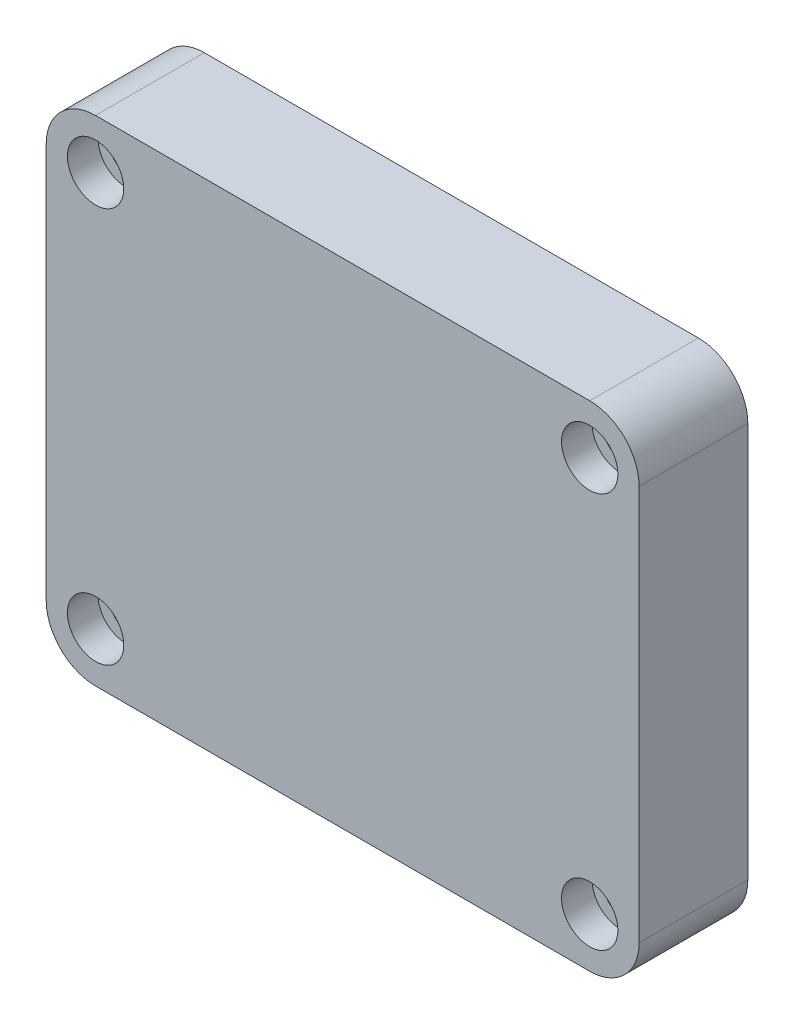
ISO-10303-21;
HEADER;
FILE_DESCRIPTION(('STEP AP214'),'2;1');
FILE_NAME('part.step','',(''),(''),'','','');
FILE_SCHEMA(('AUTOMOTIVE_DESIGN { 1 0 10303 214 1 1 1 1 }'));
ENDSEC;
DATA;
#1=APPLICATION_CONTEXT('core data for automotive mechanical design processes');
#2=APPLICATION_PROTOCOL_DEFINITION('international standard','automotive_design',2000,#1);
#3=PRODUCT_CONTEXT('',#1,'mechanical');
#4=PRODUCT('Part','Part','',(#3));
#5=PRODUCT_RELATED_PRODUCT_CATEGORY('part','',(#4));
#6=PRODUCT_DEFINITION_FORMATION('','',#4);
#7=PRODUCT_DEFINITION_CONTEXT('part definition',#1,'design');
#8=PRODUCT_DEFINITION('design','',#6,#7);
#9=PRODUCT_DEFINITION_SHAPE('','',#8);
#10=(LENGTH_UNIT() NAMED_UNIT(*) SI_UNIT(.MILLI.,.METRE.));
#11=(NAMED_UNIT(*) PLANE_ANGLE_UNIT() SI_UNIT($,.RADIAN.));
#12=(NAMED_UNIT(*) SI_UNIT($,.STERADIAN.) SOLID_ANGLE_UNIT());
#13=UNCERTAINTY_MEASURE_WITH_UNIT(LENGTH_MEASURE(1.E-05),#10,'distance_accuracy_value','');
#14=(GEOMETRIC_REPRESENTATION_CONTEXT(3) GLOBAL_UNCERTAINTY_ASSIGNED_CONTEXT((#13)) GLOBAL_UNIT_ASSIGNED_CONTEXT((#10,
#11,#12)) REPRESENTATION_CONTEXT('',''));
#15=CARTESIAN_POINT('',(0.,0.,0.));
#16=DIRECTION('',(0.,0.,1.));
#17=DIRECTION('',(1.,0.,0.));
#18=AXIS2_PLACEMENT_3D('',#15,#16,#17);
#19=CARTESIAN_POINT('',(0.,0.,-3.));
#20=DIRECTION('',(0.,0.,1.));
#21=DIRECTION('',(1.,0.,0.));
#22=AXIS2_PLACEMENT_3D('',#19,#20,#21);
#23=PLANE('',#22);
#24=CARTESIAN_POINT('',(0.,17.17,-3.));
#25=DIRECTION('',(0.,0.,-1.));
#26=DIRECTION('',(-1.,0.,0.));
#27=AXIS2_PLACEMENT_3D('',#24,#25,#26);
#28=CIRCLE('',#27,1.75);
#29=CARTESIAN_POINT('',(-1.75,17.17,-3.));
#30=VERTEX_POINT('',#29);
#31=EDGE_CURVE('E19',#30,#30,#28,.T.);
#32=ORIENTED_EDGE('',*,*,#31,.T.);
#33=EDGE_LOOP('',(#32));
#34=FACE_BOUND('',#33,.T.);
#35=ADVANCED_FACE('F16',(#34),#23,.F.);
#36=CARTESIAN_POINT('',(0.,0.,-3.));
#37=DIRECTION('',(0.,0.,1.));
#38=DIRECTION('',(1.,0.,0.));
#39=AXIS2_PLACEMENT_3D('',#36,#37,#38);
#40=PLANE('',#39);
#41=CARTESIAN_POINT('',(-15.5,4.75,-3.));
#42=DIRECTION('',(0.,0.,-1.));
#43=DIRECTION('',(-1.,0.,0.));
#44=AXIS2_PLACEMENT_3D('',#41,#42,#43);
#45=CIRCLE('',#44,1.25);
#46=CARTESIAN_POINT('',(-16.75,4.75,-3.));
#47=VERTEX_POINT('',#46);
#48=EDGE_CURVE('E281',#47,#47,#45,.T.);
#49=ORIENTED_EDGE('',*,*,#48,.T.);
#50=EDGE_LOOP('',(#49));
#51=FACE_BOUND('',#50,.T.);
#52=ADVANCED_FACE('F451',(#51),#40,.F.);
#53=CARTESIAN_POINT('',(0.,0.,-3.));
#54=DIRECTION('',(0.,0.,1.));
#55=DIRECTION('',(1.,0.,0.));
#56=AXIS2_PLACEMENT_3D('',#53,#54,#55);
#57=PLANE('',#56);
#58=CARTESIAN_POINT('',(15.5,4.75,-3.));
#59=DIRECTION('',(0.,0.,-1.));
#60=DIRECTION('',(-1.,0.,0.));
#61=AXIS2_PLACEMENT_3D('',#58,#59,#60);
#62=CIRCLE('',#61,1.25);
#63=CARTESIAN_POINT('',(14.25,4.75,-3.));
#64=VERTEX_POINT('',#63);
#65=EDGE_CURVE('E279',#64,#64,#62,.T.);
#66=ORIENTED_EDGE('',*,*,#65,.T.);
#67=EDGE_LOOP('',(#66));
#68=FACE_BOUND('',#67,.T.);
#69=ADVANCED_FACE('F293',(#68),#57,.F.);
#70=CARTESIAN_POINT('',(0.,17.17,0.));
#71=DIRECTION('',(0.,0.,-1.));
#72=DIRECTION('',(-1.,0.,0.));
#73=AXIS2_PLACEMENT_3D('',#70,#71,#72);
#74=CYLINDRICAL_SURFACE('',#73,1.75);
#75=ORIENTED_EDGE('',*,*,#31,.F.);
#76=EDGE_LOOP('',(#75));
#77=FACE_BOUND('',#76,.T.);
#78=CARTESIAN_POINT('',(0.,17.17,-11.));
#79=DIRECTION('',(0.,0.,-1.));
#80=DIRECTION('',(-1.,0.,0.));
#81=AXIS2_PLACEMENT_3D('',#78,#79,#80);
#82=CIRCLE('',#81,1.75);
#83=CARTESIAN_POINT('',(-1.75,17.17,-11.));
#84=VERTEX_POINT('',#83);
#85=EDGE_CURVE('E276',#84,#84,#82,.T.);
#86=ORIENTED_EDGE('',*,*,#85,.T.);
#87=EDGE_LOOP('',(#86));
#88=FACE_BOUND('',#87,.T.);
#89=ADVANCED_FACE('F289',(#77,#88),#74,.F.);
#90=CARTESIAN_POINT('',(-15.5,4.75,0.));
#91=DIRECTION('',(0.,0.,-1.));
#92=DIRECTION('',(-1.,0.,0.));
#93=AXIS2_PLACEMENT_3D('',#90,#91,#92);
#94=CYLINDRICAL_SURFACE('',#93,1.25);
#95=ORIENTED_EDGE('',*,*,#48,.F.);
#96=EDGE_LOOP('',(#95));
#97=FACE_BOUND('',#96,.T.);
#98=CARTESIAN_POINT('',(-15.5,4.75,-11.));
#99=DIRECTION('',(0.,0.,-1.));
#100=DIRECTION('',(-1.,0.,0.));
#101=AXIS2_PLACEMENT_3D('',#98,#99,#100);
#102=CIRCLE('',#101,1.25);
#103=CARTESIAN_POINT('',(-16.75,4.75,-11.));
#104=VERTEX_POINT('',#103);
#105=EDGE_CURVE('E273',#104,#104,#102,.T.);
#106=ORIENTED_EDGE('',*,*,#105,.T.);
#107=EDGE_LOOP('',(#106));
#108=FACE_BOUND('',#107,.T.);
#109=ADVANCED_FACE('F292',(#97,#108),#94,.F.);
#110=CARTESIAN_POINT('',(15.5,4.75,0.));
#111=DIRECTION('',(0.,0.,-1.));
#112=DIRECTION('',(-1.,0.,0.));
#113=AXIS2_PLACEMENT_3D('',#110,#111,#112);
#114=CYLINDRICAL_SURFACE('',#113,1.25);
#115=ORIENTED_EDGE('',*,*,#65,.F.);
#116=EDGE_LOOP('',(#115));
#117=FACE_BOUND('',#116,.T.);
#118=CARTESIAN_POINT('',(15.5,4.75,-11.));
#119=DIRECTION('',(0.,0.,-1.));
#120=DIRECTION('',(-1.,0.,0.));
#121=AXIS2_PLACEMENT_3D('',#118,#119,#120);
#122=CIRCLE('',#121,1.25);
#123=CARTESIAN_POINT('',(14.25,4.75,-11.));
#124=VERTEX_POINT('',#123);
#125=EDGE_CURVE('E178',#124,#124,#122,.T.);
#126=ORIENTED_EDGE('',*,*,#125,.T.);
#127=EDGE_LOOP('',(#126));
#128=FACE_BOUND('',#127,.T.);
#129=ADVANCED_FACE('F301',(#117,#128),#114,.F.);
#130=CARTESIAN_POINT('',(0.,17.17,-11.));
#131=DIRECTION('',(0.,0.,1.));
#132=DIRECTION('',(1.,0.,0.));
#133=AXIS2_PLACEMENT_3D('',#130,#131,#132);
#134=PLANE('',#133);
#135=ORIENTED_EDGE('',*,*,#85,.F.);
#136=EDGE_LOOP('',(#135));
#137=FACE_BOUND('',#136,.T.);
#138=CARTESIAN_POINT('',(0.,17.17,-11.));
#139=DIRECTION('',(0.,0.,-1.));
#140=DIRECTION('',(-1.,0.,0.));
#141=AXIS2_PLACEMENT_3D('',#138,#139,#140);
#142=CIRCLE('',#141,3.3);
#143=CARTESIAN_POINT('',(-3.3,17.17,-11.));
#144=VERTEX_POINT('',#143);
#145=EDGE_CURVE('E174',#144,#144,#142,.F.);
#146=ORIENTED_EDGE('',*,*,#145,.F.);
#147=EDGE_LOOP('',(#146));
#148=FACE_BOUND('',#147,.T.);
#149=ADVANCED_FACE('F297',(#137,#148),#134,.F.);
#150=CARTESIAN_POINT('',(-15.5,4.75,-11.));
#151=DIRECTION('',(0.,0.,1.));
#152=DIRECTION('',(1.,0.,0.));
#153=AXIS2_PLACEMENT_3D('',#150,#151,#152);
#154=PLANE('',#153);
#155=ORIENTED_EDGE('',*,*,#105,.F.);
#156=EDGE_LOOP('',(#155));
#157=FACE_BOUND('',#156,.T.);
#158=CARTESIAN_POINT('',(-15.5,4.75,-11.));
#159=DIRECTION('',(0.,0.,-1.));
#160=DIRECTION('',(-1.,0.,0.));
#161=AXIS2_PLACEMENT_3D('',#158,#159,#160);
#162=CIRCLE('',#161,3.);
#163=CARTESIAN_POINT('',(-18.5,4.75,-11.));
#164=VERTEX_POINT('',#163);
#165=EDGE_CURVE('E266',#164,#164,#162,.F.);
#166=ORIENTED_EDGE('',*,*,#165,.F.);
#167=EDGE_LOOP('',(#166));
#168=FACE_BOUND('',#167,.T.);
#169=ADVANCED_FACE('F300',(#157,#168),#154,.F.);
#170=CARTESIAN_POINT('',(15.5,4.75,-11.));
#171=DIRECTION('',(0.,0.,1.));
#172=DIRECTION('',(1.,0.,0.));
#173=AXIS2_PLACEMENT_3D('',#170,#171,#172);
#174=PLANE('',#173);
#175=ORIENTED_EDGE('',*,*,#125,.F.);
#176=EDGE_LOOP('',(#175));
#177=FACE_BOUND('',#176,.T.);
#178=CARTESIAN_POINT('',(15.5,4.75,-11.));
#179=DIRECTION('',(0.,0.,-1.));
#180=DIRECTION('',(-1.,0.,0.));
#181=AXIS2_PLACEMENT_3D('',#178,#179,#180);
#182=CIRCLE('',#181,3.);
#183=CARTESIAN_POINT('',(12.5,4.75,-11.));
#184=VERTEX_POINT('',#183);
#185=EDGE_CURVE('E180',#184,#184,#182,.F.);
#186=ORIENTED_EDGE('',*,*,#185,.F.);
#187=EDGE_LOOP('',(#186));
#188=FACE_BOUND('',#187,.T.);
#189=ADVANCED_FACE('F428',(#177,#188),#174,.F.);
#190=CARTESIAN_POINT('',(25.,20.,0.));
#191=DIRECTION('',(0.,0.,-1.));
#192=DIRECTION('',(-1.,0.,0.));
#193=AXIS2_PLACEMENT_3D('',#190,#191,#192);
#194=CYLINDRICAL_SURFACE('',#193,5.);
#195=CARTESIAN_POINT('',(25.,20.,-11.));
#196=DIRECTION('',(0.,0.,-1.));
#197=DIRECTION('',(-1.,0.,0.));
#198=AXIS2_PLACEMENT_3D('',#195,#196,#197);
#199=CIRCLE('',#198,5.);
#200=CARTESIAN_POINT('',(20.417424448119,22.0000003278255,-11.));
#201=VERTEX_POINT('',#200);
#202=CARTESIAN_POINT('',(27.0000004023314,15.417424480636,-11.));
#203=VERTEX_POINT('',#202);
#204=EDGE_CURVE('E153',#201,#203,#199,.F.);
#205=ORIENTED_EDGE('',*,*,#204,.T.);
#206=DIRECTION('',(0.,0.,1.));
#207=VECTOR('',#206,1.);
#208=CARTESIAN_POINT('',(27.0000004023314,15.417424480636,0.));
#209=LINE('',#208,#207);
#210=CARTESIAN_POINT('',(27.0000004023314,15.417424480636,-3.));
#211=VERTEX_POINT('',#210);
#212=EDGE_CURVE('E127',#211,#203,#209,.F.);
#213=ORIENTED_EDGE('',*,*,#212,.F.);
#214=CARTESIAN_POINT('',(25.,20.,-3.));
#215=DIRECTION('',(0.,0.,-1.));
#216=DIRECTION('',(-1.,0.,0.));
#217=AXIS2_PLACEMENT_3D('',#214,#215,#216);
#218=CIRCLE('',#217,5.);
#219=CARTESIAN_POINT('',(20.417424448119,22.0000003278255,-3.));
#220=VERTEX_POINT('',#219);
#221=EDGE_CURVE('E254',#211,#220,#218,.T.);
#222=ORIENTED_EDGE('',*,*,#221,.T.);
#223=DIRECTION('',(0.,0.,-1.));
#224=VECTOR('',#223,1.);
#225=CARTESIAN_POINT('',(20.417424448119,22.0000003278255,0.));
#226=LINE('',#225,#224);
#227=EDGE_CURVE('E175',#201,#220,#226,.F.);
#228=ORIENTED_EDGE('',*,*,#227,.F.);
#229=EDGE_LOOP('',(#205,#213,#222,#228));
#230=FACE_BOUND('',#229,.T.);
#231=ADVANCED_FACE('F430',(#230),#194,.T.);
#232=CARTESIAN_POINT('',(20.417424448119,22.0000003278255,0.));
#233=DIRECTION('',(0.,-1.,0.));
#234=DIRECTION('',(0.,0.,-1.));
#235=AXIS2_PLACEMENT_3D('',#232,#233,#234);
#236=PLANE('',#235);
#237=DIRECTION('',(1.,0.,0.));
#238=VECTOR('',#237,1.);
#239=CARTESIAN_POINT('',(0.,22.0000003278255,-11.));
#240=LINE('',#239,#238);
#241=CARTESIAN_POINT('',(-20.417424448119,22.0000003278255,-11.));
#242=VERTEX_POINT('',#241);
#243=EDGE_CURVE('E124',#242,#201,#240,.T.);
#244=ORIENTED_EDGE('',*,*,#243,.T.);
#245=ORIENTED_EDGE('',*,*,#227,.T.);
#246=DIRECTION('',(1.,0.,0.));
#247=VECTOR('',#246,1.);
#248=CARTESIAN_POINT('',(0.,22.0000003278255,-3.));
#249=LINE('',#248,#247);
#250=CARTESIAN_POINT('',(-20.417424448119,22.0000003278255,-3.));
#251=VERTEX_POINT('',#250);
#252=EDGE_CURVE('E253',#220,#251,#249,.F.);
#253=ORIENTED_EDGE('',*,*,#252,.T.);
#254=DIRECTION('',(0.,0.,-1.));
#255=VECTOR('',#254,1.);
#256=CARTESIAN_POINT('',(-20.417424448119,22.0000003278255,0.));
#257=LINE('',#256,#255);
#258=EDGE_CURVE('E172',#242,#251,#257,.F.);
#259=ORIENTED_EDGE('',*,*,#258,.F.);
#260=EDGE_LOOP('',(#244,#245,#253,#259));
#261=FACE_BOUND('',#260,.T.);
#262=ADVANCED_FACE('F318',(#261),#236,.T.);
#263=CARTESIAN_POINT('',(-25.,20.,0.));
#264=DIRECTION('',(0.,0.,-1.));
#265=DIRECTION('',(-1.,0.,0.));
#266=AXIS2_PLACEMENT_3D('',#263,#264,#265);
#267=CYLINDRICAL_SURFACE('',#266,5.);
#268=CARTESIAN_POINT('',(-25.,20.,-11.));
#269=DIRECTION('',(0.,0.,-1.));
#270=DIRECTION('',(-1.,0.,0.));
#271=AXIS2_PLACEMENT_3D('',#268,#269,#270);
#272=CIRCLE('',#271,5.);
#273=CARTESIAN_POINT('',(-27.0000004023314,15.417424480636,-11.));
#274=VERTEX_POINT('',#273);
#275=EDGE_CURVE('E114',#274,#242,#272,.F.);
#276=ORIENTED_EDGE('',*,*,#275,.T.);
#277=ORIENTED_EDGE('',*,*,#258,.T.);
#278=CARTESIAN_POINT('',(-25.,20.,-3.));
#279=DIRECTION('',(0.,0.,-1.));
#280=DIRECTION('',(-1.,0.,0.));
#281=AXIS2_PLACEMENT_3D('',#278,#279,#280);
#282=CIRCLE('',#281,5.);
#283=CARTESIAN_POINT('',(-27.0000004023314,15.417424480636,-3.));
#284=VERTEX_POINT('',#283);
#285=EDGE_CURVE('E133',#251,#284,#282,.T.);
#286=ORIENTED_EDGE('',*,*,#285,.T.);
#287=DIRECTION('',(0.,0.,-1.));
#288=VECTOR('',#287,1.);
#289=CARTESIAN_POINT('',(-27.0000004023314,15.417424480636,0.));
#290=LINE('',#289,#288);
#291=EDGE_CURVE('E130',#274,#284,#290,.F.);
#292=ORIENTED_EDGE('',*,*,#291,.F.);
#293=EDGE_LOOP('',(#276,#277,#286,#292));
#294=FACE_BOUND('',#293,.T.);
#295=ADVANCED_FACE('F131',(#294),#267,.T.);
#296=CARTESIAN_POINT('',(0.,17.17,0.));
#297=DIRECTION('',(0.,0.,-1.));
#298=DIRECTION('',(-1.,0.,0.));
#299=AXIS2_PLACEMENT_3D('',#296,#297,#298);
#300=CYLINDRICAL_SURFACE('',#299,3.3);
#301=CARTESIAN_POINT('',(0.,17.17,-3.));
#302=DIRECTION('',(0.,0.,-1.));
#303=DIRECTION('',(-1.,0.,0.));
#304=AXIS2_PLACEMENT_3D('',#301,#302,#303);
#305=CIRCLE('',#304,3.3);
#306=CARTESIAN_POINT('',(-3.3,17.17,-3.));
#307=VERTEX_POINT('',#306);
#308=EDGE_CURVE('E248',#307,#307,#305,.T.);
#309=ORIENTED_EDGE('',*,*,#308,.T.);
#310=EDGE_LOOP('',(#309));
#311=FACE_BOUND('',#310,.T.);
#312=ORIENTED_EDGE('',*,*,#145,.T.);
#313=EDGE_LOOP('',(#312));
#314=FACE_BOUND('',#313,.T.);
#315=ADVANCED_FACE('F305',(#311,#314),#300,.T.);
#316=CARTESIAN_POINT('',(-15.5,4.75,0.));
#317=DIRECTION('',(0.,0.,-1.));
#318=DIRECTION('',(-1.,0.,0.));
#319=AXIS2_PLACEMENT_3D('',#316,#317,#318);
#320=CYLINDRICAL_SURFACE('',#319,3.);
#321=CARTESIAN_POINT('',(-15.5,4.75,-3.));
#322=DIRECTION('',(0.,0.,-1.));
#323=DIRECTION('',(-1.,0.,0.));
#324=AXIS2_PLACEMENT_3D('',#321,#322,#323);
#325=CIRCLE('',#324,3.);
#326=CARTESIAN_POINT('',(-18.5,4.75,-3.));
#327=VERTEX_POINT('',#326);
#328=EDGE_CURVE('E245',#327,#327,#325,.T.);
#329=ORIENTED_EDGE('',*,*,#328,.T.);
#330=EDGE_LOOP('',(#329));
#331=FACE_BOUND('',#330,.T.);
#332=ORIENTED_EDGE('',*,*,#165,.T.);
#333=EDGE_LOOP('',(#332));
#334=FACE_BOUND('',#333,.T.);
#335=ADVANCED_FACE('F307',(#331,#334),#320,.T.);
#336=CARTESIAN_POINT('',(15.5,4.75,0.));
#337=DIRECTION('',(0.,0.,-1.));
#338=DIRECTION('',(-1.,0.,0.));
#339=AXIS2_PLACEMENT_3D('',#336,#337,#338);
#340=CYLINDRICAL_SURFACE('',#339,3.);
#341=CARTESIAN_POINT('',(15.5,4.75,-3.));
#342=DIRECTION('',(0.,0.,-1.));
#343=DIRECTION('',(-1.,0.,0.));
#344=AXIS2_PLACEMENT_3D('',#341,#342,#343);
#345=CIRCLE('',#344,3.);
#346=CARTESIAN_POINT('',(12.5,4.75,-3.));
#347=VERTEX_POINT('',#346);
#348=EDGE_CURVE('E242',#347,#347,#345,.T.);
#349=ORIENTED_EDGE('',*,*,#348,.T.);
#350=EDGE_LOOP('',(#349));
#351=FACE_BOUND('',#350,.T.);
#352=ORIENTED_EDGE('',*,*,#185,.T.);
#353=EDGE_LOOP('',(#352));
#354=FACE_BOUND('',#353,.T.);
#355=ADVANCED_FACE('F315',(#351,#354),#340,.T.);
#356=CARTESIAN_POINT('',(25.,20.,0.));
#357=DIRECTION('',(0.,0.,-1.));
#358=DIRECTION('',(-1.,0.,0.));
#359=AXIS2_PLACEMENT_3D('',#356,#357,#358);
#360=CYLINDRICAL_SURFACE('',#359,1.6);
#361=CARTESIAN_POINT('',(25.,20.,-3.1));
#362=DIRECTION('',(0.,0.,-1.));
#363=DIRECTION('',(-1.,0.,0.));
#364=AXIS2_PLACEMENT_3D('',#361,#362,#363);
#365=CIRCLE('',#364,1.6);
#366=CARTESIAN_POINT('',(23.4,20.,-3.1));
#367=VERTEX_POINT('',#366);
#368=EDGE_CURVE('E239',#367,#367,#365,.T.);
#369=ORIENTED_EDGE('',*,*,#368,.F.);
#370=EDGE_LOOP('',(#369));
#371=FACE_BOUND('',#370,.T.);
#372=CARTESIAN_POINT('',(25.,20.,-11.));
#373=DIRECTION('',(0.,0.,-1.));
#374=DIRECTION('',(-1.,0.,0.));
#375=AXIS2_PLACEMENT_3D('',#372,#373,#374);
#376=CIRCLE('',#375,1.6);
#377=CARTESIAN_POINT('',(23.4,20.,-11.));
#378=VERTEX_POINT('',#377);
#379=EDGE_CURVE('E152',#378,#378,#376,.T.);
#380=ORIENTED_EDGE('',*,*,#379,.T.);
#381=EDGE_LOOP('',(#380));
#382=FACE_BOUND('',#381,.T.);
#383=ADVANCED_FACE('F415',(#371,#382),#360,.F.);
#384=CARTESIAN_POINT('',(25.,-20.,0.));
#385=DIRECTION('',(0.,0.,-1.));
#386=DIRECTION('',(-1.,0.,0.));
#387=AXIS2_PLACEMENT_3D('',#384,#385,#386);
#388=CYLINDRICAL_SURFACE('',#387,1.6);
#389=CARTESIAN_POINT('',(25.,-20.,-3.1));
#390=DIRECTION('',(0.,0.,-1.));
#391=DIRECTION('',(-1.,0.,0.));
#392=AXIS2_PLACEMENT_3D('',#389,#390,#391);
#393=CIRCLE('',#392,1.6);
#394=CARTESIAN_POINT('',(23.4,-20.,-3.1));
#395=VERTEX_POINT('',#394);
#396=EDGE_CURVE('E236',#395,#395,#393,.T.);
#397=ORIENTED_EDGE('',*,*,#396,.F.);
#398=EDGE_LOOP('',(#397));
#399=FACE_BOUND('',#398,.T.);
#400=CARTESIAN_POINT('',(25.,-20.,-11.));
#401=DIRECTION('',(0.,0.,-1.));
#402=DIRECTION('',(-1.,0.,0.));
#403=AXIS2_PLACEMENT_3D('',#400,#401,#402);
#404=CIRCLE('',#403,1.6);
#405=CARTESIAN_POINT('',(23.4,-20.,-11.));
#406=VERTEX_POINT('',#405);
#407=EDGE_CURVE('E142',#406,#406,#404,.T.);
#408=ORIENTED_EDGE('',*,*,#407,.T.);
#409=EDGE_LOOP('',(#408));
#410=FACE_BOUND('',#409,.T.);
#411=ADVANCED_FACE('F411',(#399,#410),#388,.F.);
#412=CARTESIAN_POINT('',(-25.,20.,0.));
#413=DIRECTION('',(0.,0.,-1.));
#414=DIRECTION('',(-1.,0.,0.));
#415=AXIS2_PLACEMENT_3D('',#412,#413,#414);
#416=CYLINDRICAL_SURFACE('',#415,1.6);
#417=CARTESIAN_POINT('',(-25.,20.,-3.1));
#418=DIRECTION('',(0.,0.,-1.));
#419=DIRECTION('',(-1.,0.,0.));
#420=AXIS2_PLACEMENT_3D('',#417,#418,#419);
#421=CIRCLE('',#420,1.6);
#422=CARTESIAN_POINT('',(-26.6,20.,-3.1));
#423=VERTEX_POINT('',#422);
#424=EDGE_CURVE('E233',#423,#423,#421,.T.);
#425=ORIENTED_EDGE('',*,*,#424,.F.);
#426=EDGE_LOOP('',(#425));
#427=FACE_BOUND('',#426,.T.);
#428=CARTESIAN_POINT('',(-25.,20.,-11.));
#429=DIRECTION('',(0.,0.,-1.));
#430=DIRECTION('',(-1.,0.,0.));
#431=AXIS2_PLACEMENT_3D('',#428,#429,#430);
#432=CIRCLE('',#431,1.6);
#433=CARTESIAN_POINT('',(-26.6,20.,-11.));
#434=VERTEX_POINT('',#433);
#435=EDGE_CURVE('E258',#434,#434,#432,.T.);
#436=ORIENTED_EDGE('',*,*,#435,.T.);
#437=EDGE_LOOP('',(#436));
#438=FACE_BOUND('',#437,.T.);
#439=ADVANCED_FACE('F407',(#427,#438),#416,.F.);
#440=CARTESIAN_POINT('',(-25.,-20.,0.));
#441=DIRECTION('',(0.,0.,-1.));
#442=DIRECTION('',(-1.,0.,0.));
#443=AXIS2_PLACEMENT_3D('',#440,#441,#442);
#444=CYLINDRICAL_SURFACE('',#443,1.6);
#445=CARTESIAN_POINT('',(-25.,-20.,-3.1));
#446=DIRECTION('',(0.,0.,-1.));
#447=DIRECTION('',(-1.,0.,0.));
#448=AXIS2_PLACEMENT_3D('',#445,#446,#447);
#449=CIRCLE('',#448,1.6);
#450=CARTESIAN_POINT('',(-26.6,-20.,-3.1));
#451=VERTEX_POINT('',#450);
#452=EDGE_CURVE('E230',#451,#451,#449,.T.);
#453=ORIENTED_EDGE('',*,*,#452,.F.);
#454=EDGE_LOOP('',(#453));
#455=FACE_BOUND('',#454,.T.);
#456=CARTESIAN_POINT('',(-25.,-20.,-11.));
#457=DIRECTION('',(0.,0.,-1.));
#458=DIRECTION('',(-1.,0.,0.));
#459=AXIS2_PLACEMENT_3D('',#456,#457,#458);
#460=CIRCLE('',#459,1.6);
#461=CARTESIAN_POINT('',(-26.6,-20.,-11.));
#462=VERTEX_POINT('',#461);
#463=EDGE_CURVE('E145',#462,#462,#460,.T.);
#464=ORIENTED_EDGE('',*,*,#463,.T.);
#465=EDGE_LOOP('',(#464));
#466=FACE_BOUND('',#465,.T.);
#467=ADVANCED_FACE('F403',(#455,#466),#444,.F.);
#468=CARTESIAN_POINT('',(27.0000004023314,-15.417424480636,0.));
#469=DIRECTION('',(-1.,0.,0.));
#470=DIRECTION('',(0.,0.,1.));
#471=AXIS2_PLACEMENT_3D('',#468,#469,#470);
#472=PLANE('',#471);
#473=DIRECTION('',(0.,1.,0.));
#474=VECTOR('',#473,1.);
#475=CARTESIAN_POINT('',(27.0000004023314,0.,-11.));
#476=LINE('',#475,#474);
#477=CARTESIAN_POINT('',(27.0000004023314,-15.417424480636,-11.));
#478=VERTEX_POINT('',#477);
#479=EDGE_CURVE('E150',#203,#478,#476,.F.);
#480=ORIENTED_EDGE('',*,*,#479,.T.);
#481=DIRECTION('',(0.,0.,-1.));
#482=VECTOR('',#481,1.);
#483=CARTESIAN_POINT('',(27.0000004023314,-15.417424480636,0.));
#484=LINE('',#483,#482);
#485=CARTESIAN_POINT('',(27.0000004023314,-15.417424480636,-3.));
#486=VERTEX_POINT('',#485);
#487=EDGE_CURVE('E167',#486,#478,#484,.T.);
#488=ORIENTED_EDGE('',*,*,#487,.F.);
#489=DIRECTION('',(0.,1.,0.));
#490=VECTOR('',#489,1.);
#491=CARTESIAN_POINT('',(27.0000004023314,0.,-3.));
#492=LINE('',#491,#490);
#493=EDGE_CURVE('E136',#486,#211,#492,.T.);
#494=ORIENTED_EDGE('',*,*,#493,.T.);
#495=ORIENTED_EDGE('',*,*,#212,.T.);
#496=EDGE_LOOP('',(#480,#488,#494,#495));
#497=FACE_BOUND('',#496,.T.);
#498=ADVANCED_FACE('F399',(#497),#472,.T.);
#499=CARTESIAN_POINT('',(0.,0.,-11.));
#500=DIRECTION('',(0.,0.,1.));
#501=DIRECTION('',(1.,0.,0.));
#502=AXIS2_PLACEMENT_3D('',#499,#500,#501);
#503=PLANE('',#502);
#504=ORIENTED_EDGE('',*,*,#407,.F.);
#505=EDGE_LOOP('',(#504));
#506=FACE_BOUND('',#505,.T.);
#507=ORIENTED_EDGE('',*,*,#463,.F.);
#508=EDGE_LOOP('',(#507));
#509=FACE_BOUND('',#508,.T.);
#510=ORIENTED_EDGE('',*,*,#435,.F.);
#511=EDGE_LOOP('',(#510));
#512=FACE_BOUND('',#511,.T.);
#513=ORIENTED_EDGE('',*,*,#379,.F.);
#514=EDGE_LOOP('',(#513));
#515=FACE_BOUND('',#514,.T.);
#516=DIRECTION('',(1.,0.,0.));
#517=VECTOR('',#516,1.);
#518=CARTESIAN_POINT('',(-25.,25.,-11.));
#519=LINE('',#518,#517);
#520=CARTESIAN_POINT('',(25.,25.,-11.));
#521=VERTEX_POINT('',#520);
#522=CARTESIAN_POINT('',(-25.,25.,-11.));
#523=VERTEX_POINT('',#522);
#524=EDGE_CURVE('E159',#521,#523,#519,.F.);
#525=ORIENTED_EDGE('',*,*,#524,.F.);
#526=CARTESIAN_POINT('',(25.,20.,-11.));
#527=DIRECTION('',(0.,0.,-1.));
#528=DIRECTION('',(-1.,0.,0.));
#529=AXIS2_PLACEMENT_3D('',#526,#527,#528);
#530=CIRCLE('',#529,5.);
#531=CARTESIAN_POINT('',(30.,20.,-11.));
#532=VERTEX_POINT('',#531);
#533=EDGE_CURVE('E225',#532,#521,#530,.F.);
#534=ORIENTED_EDGE('',*,*,#533,.F.);
#535=DIRECTION('',(0.,1.,0.));
#536=VECTOR('',#535,1.);
#537=CARTESIAN_POINT('',(30.,20.,-11.));
#538=LINE('',#537,#536);
#539=CARTESIAN_POINT('',(30.,-20.,-11.));
#540=VERTEX_POINT('',#539);
#541=EDGE_CURVE('E163',#540,#532,#538,.T.);
#542=ORIENTED_EDGE('',*,*,#541,.F.);
#543=CARTESIAN_POINT('',(25.,-20.,-11.));
#544=DIRECTION('',(0.,0.,-1.));
#545=DIRECTION('',(-1.,0.,0.));
#546=AXIS2_PLACEMENT_3D('',#543,#544,#545);
#547=CIRCLE('',#546,5.);
#548=EDGE_CURVE('E169',#478,#540,#547,.F.);
#549=ORIENTED_EDGE('',*,*,#548,.F.);
#550=ORIENTED_EDGE('',*,*,#479,.F.);
#551=ORIENTED_EDGE('',*,*,#204,.F.);
#552=ORIENTED_EDGE('',*,*,#243,.F.);
#553=ORIENTED_EDGE('',*,*,#275,.F.);
#554=DIRECTION('',(0.,1.,0.));
#555=VECTOR('',#554,1.);
#556=CARTESIAN_POINT('',(-27.0000004023314,15.417424480636,-11.));
#557=LINE('',#556,#555);
#558=CARTESIAN_POINT('',(-27.0000004023314,-15.417424480636,-11.));
#559=VERTEX_POINT('',#558);
#560=EDGE_CURVE('E120',#559,#274,#557,.T.);
#561=ORIENTED_EDGE('',*,*,#560,.F.);
#562=CARTESIAN_POINT('',(-25.,-20.,-11.));
#563=DIRECTION('',(0.,0.,-1.));
#564=DIRECTION('',(-1.,0.,0.));
#565=AXIS2_PLACEMENT_3D('',#562,#563,#564);
#566=CIRCLE('',#565,5.);
#567=CARTESIAN_POINT('',(-30.,-20.,-11.));
#568=VERTEX_POINT('',#567);
#569=EDGE_CURVE('E221',#568,#559,#566,.F.);
#570=ORIENTED_EDGE('',*,*,#569,.F.);
#571=DIRECTION('',(0.,1.,0.));
#572=VECTOR('',#571,1.);
#573=CARTESIAN_POINT('',(-30.,-20.,-11.));
#574=LINE('',#573,#572);
#575=CARTESIAN_POINT('',(-30.,20.,-11.));
#576=VERTEX_POINT('',#575);
#577=EDGE_CURVE('E155',#576,#568,#574,.F.);
#578=ORIENTED_EDGE('',*,*,#577,.F.);
#579=CARTESIAN_POINT('',(-25.,20.,-11.));
#580=DIRECTION('',(0.,0.,-1.));
#581=DIRECTION('',(-1.,0.,0.));
#582=AXIS2_PLACEMENT_3D('',#579,#580,#581);
#583=CIRCLE('',#582,5.);
#584=EDGE_CURVE('E223',#523,#576,#583,.F.);
#585=ORIENTED_EDGE('',*,*,#584,.F.);
#586=EDGE_LOOP('',(#525,#534,#542,#549,#550,#551,#552,#553,#561,#570,#578,#585));
#587=FACE_BOUND('',#586,.T.);
#588=ADVANCED_FACE('F117',(#506,#509,#512,#515,#587),#503,.F.);
#589=CARTESIAN_POINT('',(-27.0000004023314,15.417424480636,0.));
#590=DIRECTION('',(1.,0.,0.));
#591=DIRECTION('',(0.,0.,-1.));
#592=AXIS2_PLACEMENT_3D('',#589,#590,#591);
#593=PLANE('',#592);
#594=ORIENTED_EDGE('',*,*,#560,.T.);
#595=ORIENTED_EDGE('',*,*,#291,.T.);
#596=DIRECTION('',(0.,1.,0.));
#597=VECTOR('',#596,1.);
#598=CARTESIAN_POINT('',(-27.0000004023314,0.,-3.));
#599=LINE('',#598,#597);
#600=CARTESIAN_POINT('',(-27.0000004023314,-15.417424480636,-3.));
#601=VERTEX_POINT('',#600);
#602=EDGE_CURVE('E251',#284,#601,#599,.F.);
#603=ORIENTED_EDGE('',*,*,#602,.T.);
#604=DIRECTION('',(0.,0.,-1.));
#605=VECTOR('',#604,1.);
#606=CARTESIAN_POINT('',(-27.0000004023314,-15.417424480636,0.));
#607=LINE('',#606,#605);
#608=EDGE_CURVE('E140',#559,#601,#607,.F.);
#609=ORIENTED_EDGE('',*,*,#608,.F.);
#610=EDGE_LOOP('',(#594,#595,#603,#609));
#611=FACE_BOUND('',#610,.T.);
#612=ADVANCED_FACE('F138',(#611),#593,.T.);
#613=CARTESIAN_POINT('',(0.,0.,-3.));
#614=DIRECTION('',(0.,0.,1.));
#615=DIRECTION('',(1.,0.,0.));
#616=AXIS2_PLACEMENT_3D('',#613,#614,#615);
#617=PLANE('',#616);
#618=ORIENTED_EDGE('',*,*,#348,.F.);
#619=EDGE_LOOP('',(#618));
#620=FACE_BOUND('',#619,.T.);
#621=ORIENTED_EDGE('',*,*,#328,.F.);
#622=EDGE_LOOP('',(#621));
#623=FACE_BOUND('',#622,.T.);
#624=ORIENTED_EDGE('',*,*,#308,.F.);
#625=EDGE_LOOP('',(#624));
#626=FACE_BOUND('',#625,.T.);
#627=DIRECTION('',(1.,0.,0.));
#628=VECTOR('',#627,1.);
#629=CARTESIAN_POINT('',(25.,-25.,-3.));
#630=LINE('',#629,#628);
#631=CARTESIAN_POINT('',(-25.,-25.,-3.));
#632=VERTEX_POINT('',#631);
#633=CARTESIAN_POINT('',(25.,-25.,-3.));
#634=VERTEX_POINT('',#633);
#635=EDGE_CURVE('E708',#632,#634,#630,.T.);
#636=ORIENTED_EDGE('',*,*,#635,.F.);
#637=CARTESIAN_POINT('',(-25.,-20.,-3.));
#638=DIRECTION('',(0.,0.,-1.));
#639=DIRECTION('',(-1.,0.,0.));
#640=AXIS2_PLACEMENT_3D('',#637,#638,#639);
#641=CIRCLE('',#640,5.);
#642=EDGE_CURVE('E219',#601,#632,#641,.T.);
#643=ORIENTED_EDGE('',*,*,#642,.F.);
#644=ORIENTED_EDGE('',*,*,#602,.F.);
#645=ORIENTED_EDGE('',*,*,#285,.F.);
#646=ORIENTED_EDGE('',*,*,#252,.F.);
#647=ORIENTED_EDGE('',*,*,#221,.F.);
#648=ORIENTED_EDGE('',*,*,#493,.F.);
#649=CARTESIAN_POINT('',(25.,-20.,-3.));
#650=DIRECTION('',(0.,0.,-1.));
#651=DIRECTION('',(-1.,0.,0.));
#652=AXIS2_PLACEMENT_3D('',#649,#650,#651);
#653=CIRCLE('',#652,5.);
#654=EDGE_CURVE('E170',#634,#486,#653,.T.);
#655=ORIENTED_EDGE('',*,*,#654,.F.);
#656=EDGE_LOOP('',(#636,#643,#644,#645,#646,#647,#648,#655));
#657=FACE_BOUND('',#656,.T.);
#658=ADVANCED_FACE('F390',(#620,#623,#626,#657),#617,.F.);
#659=CARTESIAN_POINT('',(25.,20.,-3.1));
#660=DIRECTION('',(0.,0.,1.));
#661=DIRECTION('',(1.,0.,0.));
#662=AXIS2_PLACEMENT_3D('',#659,#660,#661);
#663=PLANE('',#662);
#664=ORIENTED_EDGE('',*,*,#368,.T.);
#665=EDGE_LOOP('',(#664));
#666=FACE_BOUND('',#665,.T.);
#667=CARTESIAN_POINT('',(25.,20.,-3.1));
#668=DIRECTION('',(0.,0.,-1.));
#669=DIRECTION('',(-1.,0.,0.));
#670=AXIS2_PLACEMENT_3D('',#667,#668,#669);
#671=CIRCLE('',#670,2.85);
#672=CARTESIAN_POINT('',(22.15,20.,-3.1));
#673=VERTEX_POINT('',#672);
#674=EDGE_CURVE('E215',#673,#673,#671,.F.);
#675=ORIENTED_EDGE('',*,*,#674,.T.);
#676=EDGE_LOOP('',(#675));
#677=FACE_BOUND('',#676,.T.);
#678=ADVANCED_FACE('F386',(#666,#677),#663,.T.);
#679=CARTESIAN_POINT('',(25.,-20.,-3.1));
#680=DIRECTION('',(0.,0.,1.));
#681=DIRECTION('',(1.,0.,0.));
#682=AXIS2_PLACEMENT_3D('',#679,#680,#681);
#683=PLANE('',#682);
#684=ORIENTED_EDGE('',*,*,#396,.T.);
#685=EDGE_LOOP('',(#684));
#686=FACE_BOUND('',#685,.T.);
#687=CARTESIAN_POINT('',(25.,-20.,-3.1));
#688=DIRECTION('',(0.,0.,-1.));
#689=DIRECTION('',(-1.,0.,0.));
#690=AXIS2_PLACEMENT_3D('',#687,#688,#689);
#691=CIRCLE('',#690,2.85);
#692=CARTESIAN_POINT('',(22.15,-20.,-3.1));
#693=VERTEX_POINT('',#692);
#694=EDGE_CURVE('E212',#693,#693,#691,.F.);
#695=ORIENTED_EDGE('',*,*,#694,.T.);
#696=EDGE_LOOP('',(#695));
#697=FACE_BOUND('',#696,.T.);
#698=ADVANCED_FACE('F382',(#686,#697),#683,.T.);
#699=CARTESIAN_POINT('',(-25.,20.,-3.1));
#700=DIRECTION('',(0.,0.,1.));
#701=DIRECTION('',(1.,0.,0.));
#702=AXIS2_PLACEMENT_3D('',#699,#700,#701);
#703=PLANE('',#702);
#704=ORIENTED_EDGE('',*,*,#424,.T.);
#705=EDGE_LOOP('',(#704));
#706=FACE_BOUND('',#705,.T.);
#707=CARTESIAN_POINT('',(-25.,20.,-3.1));
#708=DIRECTION('',(0.,0.,-1.));
#709=DIRECTION('',(-1.,0.,0.));
#710=AXIS2_PLACEMENT_3D('',#707,#708,#709);
#711=CIRCLE('',#710,2.85);
#712=CARTESIAN_POINT('',(-27.85,20.,-3.1));
#713=VERTEX_POINT('',#712);
#714=EDGE_CURVE('E209',#713,#713,#711,.F.);
#715=ORIENTED_EDGE('',*,*,#714,.T.);
#716=EDGE_LOOP('',(#715));
#717=FACE_BOUND('',#716,.T.);
#718=ADVANCED_FACE('F378',(#706,#717),#703,.T.);
#719=CARTESIAN_POINT('',(-25.,-20.,-3.1));
#720=DIRECTION('',(0.,0.,1.));
#721=DIRECTION('',(1.,0.,0.));
#722=AXIS2_PLACEMENT_3D('',#719,#720,#721);
#723=PLANE('',#722);
#724=ORIENTED_EDGE('',*,*,#452,.T.);
#725=EDGE_LOOP('',(#724));
#726=FACE_BOUND('',#725,.T.);
#727=CARTESIAN_POINT('',(-25.,-20.,-3.1));
#728=DIRECTION('',(0.,0.,-1.));
#729=DIRECTION('',(-1.,0.,0.));
#730=AXIS2_PLACEMENT_3D('',#727,#728,#729);
#731=CIRCLE('',#730,2.85);
#732=CARTESIAN_POINT('',(-27.85,-20.,-3.1));
#733=VERTEX_POINT('',#732);
#734=EDGE_CURVE('E206',#733,#733,#731,.F.);
#735=ORIENTED_EDGE('',*,*,#734,.T.);
#736=EDGE_LOOP('',(#735));
#737=FACE_BOUND('',#736,.T.);
#738=ADVANCED_FACE('F374',(#726,#737),#723,.T.);
#739=CARTESIAN_POINT('',(25.,-20.,0.));
#740=DIRECTION('',(0.,0.,-1.));
#741=DIRECTION('',(-1.,0.,0.));
#742=AXIS2_PLACEMENT_3D('',#739,#740,#741);
#743=CYLINDRICAL_SURFACE('',#742,5.);
#744=ORIENTED_EDGE('',*,*,#548,.T.);
#745=DIRECTION('',(0.,0.,-1.));
#746=VECTOR('',#745,1.);
#747=CARTESIAN_POINT('',(30.,-20.,0.));
#748=LINE('',#747,#746);
#749=CARTESIAN_POINT('',(30.,-20.,0.));
#750=VERTEX_POINT('',#749);
#751=EDGE_CURVE('E166',#750,#540,#748,.T.);
#752=ORIENTED_EDGE('',*,*,#751,.F.);
#753=CARTESIAN_POINT('',(25.,-20.,0.));
#754=DIRECTION('',(0.,0.,-1.));
#755=DIRECTION('',(-1.,0.,0.));
#756=AXIS2_PLACEMENT_3D('',#753,#754,#755);
#757=CIRCLE('',#756,5.);
#758=CARTESIAN_POINT('',(25.,-25.,0.));
#759=VERTEX_POINT('',#758);
#760=EDGE_CURVE('E203',#759,#750,#757,.F.);
#761=ORIENTED_EDGE('',*,*,#760,.F.);
#762=DIRECTION('',(0.,0.,-1.));
#763=VECTOR('',#762,1.);
#764=CARTESIAN_POINT('',(25.,-25.,0.));
#765=LINE('',#764,#763);
#766=EDGE_CURVE('E218',#634,#759,#765,.F.);
#767=ORIENTED_EDGE('',*,*,#766,.F.);
#768=ORIENTED_EDGE('',*,*,#654,.T.);
#769=ORIENTED_EDGE('',*,*,#487,.T.);
#770=EDGE_LOOP('',(#744,#752,#761,#767,#768,#769));
#771=FACE_BOUND('',#770,.T.);
#772=ADVANCED_FACE('F370',(#771),#743,.T.);
#773=CARTESIAN_POINT('',(30.,20.,0.));
#774=DIRECTION('',(1.,0.,0.));
#775=DIRECTION('',(0.,0.,-1.));
#776=AXIS2_PLACEMENT_3D('',#773,#774,#775);
#777=PLANE('',#776);
#778=ORIENTED_EDGE('',*,*,#541,.T.);
#779=DIRECTION('',(0.,0.,-1.));
#780=VECTOR('',#779,1.);
#781=CARTESIAN_POINT('',(30.,20.,0.));
#782=LINE('',#781,#780);
#783=CARTESIAN_POINT('',(30.,20.,0.));
#784=VERTEX_POINT('',#783);
#785=EDGE_CURVE('E165',#784,#532,#782,.T.);
#786=ORIENTED_EDGE('',*,*,#785,.F.);
#787=DIRECTION('',(0.,1.,0.));
#788=VECTOR('',#787,1.);
#789=CARTESIAN_POINT('',(30.,0.,0.));
#790=LINE('',#789,#788);
#791=EDGE_CURVE('E202',#750,#784,#790,.T.);
#792=ORIENTED_EDGE('',*,*,#791,.F.);
#793=ORIENTED_EDGE('',*,*,#751,.T.);
#794=EDGE_LOOP('',(#778,#786,#792,#793));
#795=FACE_BOUND('',#794,.T.);
#796=ADVANCED_FACE('F366',(#795),#777,.T.);
#797=CARTESIAN_POINT('',(25.,20.,0.));
#798=DIRECTION('',(0.,0.,-1.));
#799=DIRECTION('',(-1.,0.,0.));
#800=AXIS2_PLACEMENT_3D('',#797,#798,#799);
#801=CYLINDRICAL_SURFACE('',#800,5.);
#802=ORIENTED_EDGE('',*,*,#533,.T.);
#803=DIRECTION('',(0.,0.,1.));
#804=VECTOR('',#803,1.);
#805=CARTESIAN_POINT('',(25.,25.,0.));
#806=LINE('',#805,#804);
#807=CARTESIAN_POINT('',(25.,25.,0.));
#808=VERTEX_POINT('',#807);
#809=EDGE_CURVE('E162',#808,#521,#806,.F.);
#810=ORIENTED_EDGE('',*,*,#809,.F.);
#811=CARTESIAN_POINT('',(25.,20.,0.));
#812=DIRECTION('',(0.,0.,-1.));
#813=DIRECTION('',(-1.,0.,0.));
#814=AXIS2_PLACEMENT_3D('',#811,#812,#813);
#815=CIRCLE('',#814,5.);
#816=EDGE_CURVE('E199',#784,#808,#815,.F.);
#817=ORIENTED_EDGE('',*,*,#816,.F.);
#818=ORIENTED_EDGE('',*,*,#785,.T.);
#819=EDGE_LOOP('',(#802,#810,#817,#818));
#820=FACE_BOUND('',#819,.T.);
#821=ADVANCED_FACE('F362',(#820),#801,.T.);
#822=CARTESIAN_POINT('',(-25.,25.,0.));
#823=DIRECTION('',(0.,1.,0.));
#824=DIRECTION('',(0.,0.,1.));
#825=AXIS2_PLACEMENT_3D('',#822,#823,#824);
#826=PLANE('',#825);
#827=ORIENTED_EDGE('',*,*,#524,.T.);
#828=DIRECTION('',(0.,0.,-1.));
#829=VECTOR('',#828,1.);
#830=CARTESIAN_POINT('',(-25.,25.,0.));
#831=LINE('',#830,#829);
#832=CARTESIAN_POINT('',(-25.,25.,0.));
#833=VERTEX_POINT('',#832);
#834=EDGE_CURVE('E161',#833,#523,#831,.T.);
#835=ORIENTED_EDGE('',*,*,#834,.F.);
#836=DIRECTION('',(1.,0.,0.));
#837=VECTOR('',#836,1.);
#838=CARTESIAN_POINT('',(0.,25.,0.));
#839=LINE('',#838,#837);
#840=EDGE_CURVE('E198',#808,#833,#839,.F.);
#841=ORIENTED_EDGE('',*,*,#840,.F.);
#842=ORIENTED_EDGE('',*,*,#809,.T.);
#843=EDGE_LOOP('',(#827,#835,#841,#842));
#844=FACE_BOUND('',#843,.T.);
#845=ADVANCED_FACE('F358',(#844),#826,.T.);
#846=CARTESIAN_POINT('',(-25.,20.,0.));
#847=DIRECTION('',(0.,0.,-1.));
#848=DIRECTION('',(-1.,0.,0.));
#849=AXIS2_PLACEMENT_3D('',#846,#847,#848);
#850=CYLINDRICAL_SURFACE('',#849,5.);
#851=ORIENTED_EDGE('',*,*,#584,.T.);
#852=DIRECTION('',(0.,0.,1.));
#853=VECTOR('',#852,1.);
#854=CARTESIAN_POINT('',(-30.,20.,0.));
#855=LINE('',#854,#853);
#856=CARTESIAN_POINT('',(-30.,20.,0.));
#857=VERTEX_POINT('',#856);
#858=EDGE_CURVE('E158',#857,#576,#855,.F.);
#859=ORIENTED_EDGE('',*,*,#858,.F.);
#860=CARTESIAN_POINT('',(-25.,20.,0.));
#861=DIRECTION('',(0.,0.,-1.));
#862=DIRECTION('',(-1.,0.,0.));
#863=AXIS2_PLACEMENT_3D('',#860,#861,#862);
#864=CIRCLE('',#863,5.);
#865=EDGE_CURVE('E195',#833,#857,#864,.F.);
#866=ORIENTED_EDGE('',*,*,#865,.F.);
#867=ORIENTED_EDGE('',*,*,#834,.T.);
#868=EDGE_LOOP('',(#851,#859,#866,#867));
#869=FACE_BOUND('',#868,.T.);
#870=ADVANCED_FACE('F354',(#869),#850,.T.);
#871=CARTESIAN_POINT('',(-30.,-20.,0.));
#872=DIRECTION('',(-1.,0.,0.));
#873=DIRECTION('',(0.,0.,1.));
#874=AXIS2_PLACEMENT_3D('',#871,#872,#873);
#875=PLANE('',#874);
#876=ORIENTED_EDGE('',*,*,#577,.T.);
#877=DIRECTION('',(0.,0.,-1.));
#878=VECTOR('',#877,1.);
#879=CARTESIAN_POINT('',(-30.,-20.,0.));
#880=LINE('',#879,#878);
#881=CARTESIAN_POINT('',(-30.,-20.,0.));
#882=VERTEX_POINT('',#881);
#883=EDGE_CURVE('E157',#882,#568,#880,.T.);
#884=ORIENTED_EDGE('',*,*,#883,.F.);
#885=DIRECTION('',(0.,1.,0.));
#886=VECTOR('',#885,1.);
#887=CARTESIAN_POINT('',(-30.,0.,0.));
#888=LINE('',#887,#886);
#889=EDGE_CURVE('E194',#857,#882,#888,.F.);
#890=ORIENTED_EDGE('',*,*,#889,.F.);
#891=ORIENTED_EDGE('',*,*,#858,.T.);
#892=EDGE_LOOP('',(#876,#884,#890,#891));
#893=FACE_BOUND('',#892,.T.);
#894=ADVANCED_FACE('F351',(#893),#875,.T.);
#895=CARTESIAN_POINT('',(-25.,-20.,0.));
#896=DIRECTION('',(0.,0.,-1.));
#897=DIRECTION('',(-1.,0.,0.));
#898=AXIS2_PLACEMENT_3D('',#895,#896,#897);
#899=CYLINDRICAL_SURFACE('',#898,5.);
#900=ORIENTED_EDGE('',*,*,#642,.T.);
#901=DIRECTION('',(0.,0.,-1.));
#902=VECTOR('',#901,1.);
#903=CARTESIAN_POINT('',(-25.,-25.,0.));
#904=LINE('',#903,#902);
#905=CARTESIAN_POINT('',(-25.,-25.,0.));
#906=VERTEX_POINT('',#905);
#907=EDGE_CURVE('E34',#906,#632,#904,.T.);
#908=ORIENTED_EDGE('',*,*,#907,.F.);
#909=CARTESIAN_POINT('',(-25.,-20.,0.));
#910=DIRECTION('',(0.,0.,-1.));
#911=DIRECTION('',(-1.,0.,0.));
#912=AXIS2_PLACEMENT_3D('',#909,#910,#911);
#913=CIRCLE('',#912,5.);
#914=EDGE_CURVE('E191',#882,#906,#913,.F.);
#915=ORIENTED_EDGE('',*,*,#914,.F.);
#916=ORIENTED_EDGE('',*,*,#883,.T.);
#917=ORIENTED_EDGE('',*,*,#569,.T.);
#918=ORIENTED_EDGE('',*,*,#608,.T.);
#919=EDGE_LOOP('',(#900,#908,#915,#916,#917,#918));
#920=FACE_BOUND('',#919,.T.);
#921=ADVANCED_FACE('F347',(#920),#899,.T.);
#922=CARTESIAN_POINT('',(25.,-25.,0.));
#923=DIRECTION('',(0.,-1.,0.));
#924=DIRECTION('',(0.,0.,-1.));
#925=AXIS2_PLACEMENT_3D('',#922,#923,#924);
#926=PLANE('',#925);
#927=ORIENTED_EDGE('',*,*,#635,.T.);
#928=ORIENTED_EDGE('',*,*,#766,.T.);
#929=DIRECTION('',(1.,0.,0.));
#930=VECTOR('',#929,1.);
#931=CARTESIAN_POINT('',(0.,-25.,0.));
#932=LINE('',#931,#930);
#933=EDGE_CURVE('E190',#906,#759,#932,.T.);
#934=ORIENTED_EDGE('',*,*,#933,.F.);
#935=ORIENTED_EDGE('',*,*,#907,.T.);
#936=EDGE_LOOP('',(#927,#928,#934,#935));
#937=FACE_BOUND('',#936,.T.);
#938=ADVANCED_FACE('F343',(#937),#926,.T.);
#939=CARTESIAN_POINT('',(25.,20.,0.));
#940=DIRECTION('',(0.,0.,-1.));
#941=DIRECTION('',(-1.,0.,0.));
#942=AXIS2_PLACEMENT_3D('',#939,#940,#941);
#943=CYLINDRICAL_SURFACE('',#942,2.85);
#944=ORIENTED_EDGE('',*,*,#674,.F.);
#945=EDGE_LOOP('',(#944));
#946=FACE_BOUND('',#945,.T.);
#947=CARTESIAN_POINT('',(25.,20.,0.));
#948=DIRECTION('',(0.,0.,-1.));
#949=DIRECTION('',(-1.,0.,0.));
#950=AXIS2_PLACEMENT_3D('',#947,#948,#949);
#951=CIRCLE('',#950,2.85);
#952=CARTESIAN_POINT('',(22.15,20.,0.));
#953=VERTEX_POINT('',#952);
#954=EDGE_CURVE('E187',#953,#953,#951,.T.);
#955=ORIENTED_EDGE('',*,*,#954,.F.);
#956=EDGE_LOOP('',(#955));
#957=FACE_BOUND('',#956,.T.);
#958=ADVANCED_FACE('F339',(#946,#957),#943,.F.);
#959=CARTESIAN_POINT('',(25.,-20.,0.));
#960=DIRECTION('',(0.,0.,-1.));
#961=DIRECTION('',(-1.,0.,0.));
#962=AXIS2_PLACEMENT_3D('',#959,#960,#961);
#963=CYLINDRICAL_SURFACE('',#962,2.85);
#964=ORIENTED_EDGE('',*,*,#694,.F.);
#965=EDGE_LOOP('',(#964));
#966=FACE_BOUND('',#965,.T.);
#967=CARTESIAN_POINT('',(25.,-20.,0.));
#968=DIRECTION('',(0.,0.,-1.));
#969=DIRECTION('',(-1.,0.,0.));
#970=AXIS2_PLACEMENT_3D('',#967,#968,#969);
#971=CIRCLE('',#970,2.85);
#972=CARTESIAN_POINT('',(22.15,-20.,0.));
#973=VERTEX_POINT('',#972);
#974=EDGE_CURVE('E184',#973,#973,#971,.T.);
#975=ORIENTED_EDGE('',*,*,#974,.F.);
#976=EDGE_LOOP('',(#975));
#977=FACE_BOUND('',#976,.T.);
#978=ADVANCED_FACE('F335',(#966,#977),#963,.F.);
#979=CARTESIAN_POINT('',(-25.,20.,0.));
#980=DIRECTION('',(0.,0.,-1.));
#981=DIRECTION('',(-1.,0.,0.));
#982=AXIS2_PLACEMENT_3D('',#979,#980,#981);
#983=CYLINDRICAL_SURFACE('',#982,2.85);
#984=ORIENTED_EDGE('',*,*,#714,.F.);
#985=EDGE_LOOP('',(#984));
#986=FACE_BOUND('',#985,.T.);
#987=CARTESIAN_POINT('',(-25.,20.,0.));
#988=DIRECTION('',(0.,0.,-1.));
#989=DIRECTION('',(-1.,0.,0.));
#990=AXIS2_PLACEMENT_3D('',#987,#988,#989);
#991=CIRCLE('',#990,2.85);
#992=CARTESIAN_POINT('',(-27.85,20.,0.));
#993=VERTEX_POINT('',#992);
#994=EDGE_CURVE('E25',#993,#993,#991,.T.);
#995=ORIENTED_EDGE('',*,*,#994,.F.);
#996=EDGE_LOOP('',(#995));
#997=FACE_BOUND('',#996,.T.);
#998=ADVANCED_FACE('F328',(#986,#997),#983,.F.);
#999=CARTESIAN_POINT('',(-25.,-20.,0.));
#1000=DIRECTION('',(0.,0.,-1.));
#1001=DIRECTION('',(-1.,0.,0.));
#1002=AXIS2_PLACEMENT_3D('',#999,#1000,#1001);
#1003=CYLINDRICAL_SURFACE('',#1002,2.85);
#1004=ORIENTED_EDGE('',*,*,#734,.F.);
#1005=EDGE_LOOP('',(#1004));
#1006=FACE_BOUND('',#1005,.T.);
#1007=CARTESIAN_POINT('',(-25.,-20.,0.));
#1008=DIRECTION('',(0.,0.,-1.));
#1009=DIRECTION('',(-1.,0.,0.));
#1010=AXIS2_PLACEMENT_3D('',#1007,#1008,#1009);
#1011=CIRCLE('',#1010,2.85);
#1012=CARTESIAN_POINT('',(-27.85,-20.,0.));
#1013=VERTEX_POINT('',#1012);
#1014=EDGE_CURVE('E11',#1013,#1013,#1011,.T.);
#1015=ORIENTED_EDGE('',*,*,#1014,.F.);
#1016=EDGE_LOOP('',(#1015));
#1017=FACE_BOUND('',#1016,.T.);
#1018=ADVANCED_FACE('F322',(#1006,#1017),#1003,.F.);
#1019=CARTESIAN_POINT('',(0.,0.,0.));
#1020=DIRECTION('',(0.,0.,1.));
#1021=DIRECTION('',(1.,0.,0.));
#1022=AXIS2_PLACEMENT_3D('',#1019,#1020,#1021);
#1023=PLANE('',#1022);
#1024=ORIENTED_EDGE('',*,*,#1014,.T.);
#1025=EDGE_LOOP('',(#1024));
#1026=FACE_BOUND('',#1025,.T.);
#1027=ORIENTED_EDGE('',*,*,#994,.T.);
#1028=EDGE_LOOP('',(#1027));
#1029=FACE_BOUND('',#1028,.T.);
#1030=ORIENTED_EDGE('',*,*,#974,.T.);
#1031=EDGE_LOOP('',(#1030));
#1032=FACE_BOUND('',#1031,.T.);
#1033=ORIENTED_EDGE('',*,*,#954,.T.);
#1034=EDGE_LOOP('',(#1033));
#1035=FACE_BOUND('',#1034,.T.);
#1036=ORIENTED_EDGE('',*,*,#914,.T.);
#1037=ORIENTED_EDGE('',*,*,#933,.T.);
#1038=ORIENTED_EDGE('',*,*,#760,.T.);
#1039=ORIENTED_EDGE('',*,*,#791,.T.);
#1040=ORIENTED_EDGE('',*,*,#816,.T.);
#1041=ORIENTED_EDGE('',*,*,#840,.T.);
#1042=ORIENTED_EDGE('',*,*,#865,.T.);
#1043=ORIENTED_EDGE('',*,*,#889,.T.);
#1044=EDGE_LOOP('',(#1036,#1037,#1038,#1039,#1040,#1041,#1042,#1043));
#1045=FACE_BOUND('',#1044,.T.);
#1046=ADVANCED_FACE('F320',(#1026,#1029,#1032,#1035,#1045),#1023,.T.);
#1047=CLOSED_SHELL('',(#35,#52,#69,#89,#109,#129,#149,#169,#189,#231,#262,#295,#315,#335,#355,
#383,#411,#439,#467,#498,#588,#612,#658,#678,#698,#718,#738,#772,#796,#821,#845,#870,#894,#921,
#938,#958,#978,#998,#1018,#1046));
#1048=MANIFOLD_SOLID_BREP('B1',#1047);
#1049=ADVANCED_BREP_SHAPE_REPRESENTATION('',(#18,#1048),#14);
#1050=SHAPE_DEFINITION_REPRESENTATION(#9,#1049);
ENDSEC;
END-ISO-10303-21;
